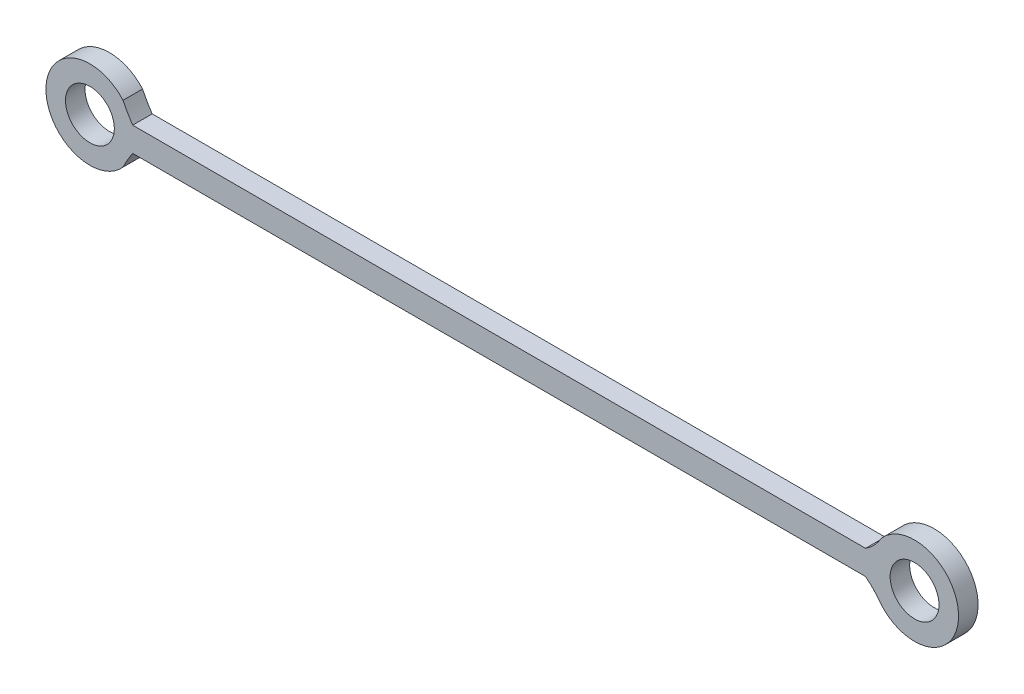
ISO-10303-21;
HEADER;
FILE_DESCRIPTION(('STEP AP214'),'2;1');
FILE_NAME('part.step','',(''),(''),'','','');
FILE_SCHEMA(('AUTOMOTIVE_DESIGN { 1 0 10303 214 1 1 1 1 }'));
ENDSEC;
DATA;
#1=APPLICATION_CONTEXT('core data for automotive mechanical design processes');
#2=APPLICATION_PROTOCOL_DEFINITION('international standard','automotive_design',2000,#1);
#3=PRODUCT_CONTEXT('',#1,'mechanical');
#4=PRODUCT('Part','Part','',(#3));
#5=PRODUCT_RELATED_PRODUCT_CATEGORY('part','',(#4));
#6=PRODUCT_DEFINITION_FORMATION('','',#4);
#7=PRODUCT_DEFINITION_CONTEXT('part definition',#1,'design');
#8=PRODUCT_DEFINITION('design','',#6,#7);
#9=PRODUCT_DEFINITION_SHAPE('','',#8);
#10=(LENGTH_UNIT() NAMED_UNIT(*) SI_UNIT(.MILLI.,.METRE.));
#11=(NAMED_UNIT(*) PLANE_ANGLE_UNIT() SI_UNIT($,.RADIAN.));
#12=(NAMED_UNIT(*) SI_UNIT($,.STERADIAN.) SOLID_ANGLE_UNIT());
#13=UNCERTAINTY_MEASURE_WITH_UNIT(LENGTH_MEASURE(1.E-05),#10,'distance_accuracy_value','');
#14=(GEOMETRIC_REPRESENTATION_CONTEXT(3) GLOBAL_UNCERTAINTY_ASSIGNED_CONTEXT((#13)) GLOBAL_UNIT_ASSIGNED_CONTEXT((#10,
#11,#12)) REPRESENTATION_CONTEXT('',''));
#15=CARTESIAN_POINT('',(0.,0.,0.));
#16=DIRECTION('',(0.,0.,1.));
#17=DIRECTION('',(1.,0.,0.));
#18=AXIS2_PLACEMENT_3D('',#15,#16,#17);
#19=CARTESIAN_POINT('',(-43.5863129452052,-18.5825445098604,4.));
#20=DIRECTION('',(0.,0.,1.));
#21=DIRECTION('',(1.,0.,0.));
#22=AXIS2_PLACEMENT_3D('',#19,#20,#21);
#23=PLANE('',#22);
#24=CARTESIAN_POINT('',(92.5,0.,4.));
#25=DIRECTION('',(0.,0.,1.));
#26=DIRECTION('',(1.,0.,0.));
#27=AXIS2_PLACEMENT_3D('',#24,#25,#26);
#28=CIRCLE('',#27,5.);
#29=CARTESIAN_POINT('',(97.5,0.,4.));
#30=VERTEX_POINT('',#29);
#31=EDGE_CURVE('E176',#30,#30,#28,.T.);
#32=ORIENTED_EDGE('',*,*,#31,.F.);
#33=EDGE_LOOP('',(#32));
#34=FACE_BOUND('',#33,.T.);
#35=CARTESIAN_POINT('',(-43.5863129452052,-18.5825445098604,4.));
#36=DIRECTION('',(0.,0.,-1.));
#37=DIRECTION('',(1.,0.,0.));
#38=AXIS2_PLACEMENT_3D('',#35,#36,#37);
#39=CIRCLE('',#38,28.8163623159094);
#40=CARTESIAN_POINT('',(-69.4720109373007,-5.92105263157895,4.));
#41=VERTEX_POINT('',#40);
#42=CARTESIAN_POINT('',(-67.4972832143122,-2.5,4.));
#43=VERTEX_POINT('',#42);
#44=EDGE_CURVE('E169',#41,#43,#39,.T.);
#45=ORIENTED_EDGE('',*,*,#44,.T.);
#46=DIRECTION('',(1.,0.,0.));
#47=VECTOR('',#46,1.);
#48=CARTESIAN_POINT('',(-67.4972832143122,-2.5,4.));
#49=LINE('',#48,#47);
#50=CARTESIAN_POINT('',(82.4769378781167,-2.5,4.));
#51=VERTEX_POINT('',#50);
#52=EDGE_CURVE('E102',#43,#51,#49,.T.);
#53=ORIENTED_EDGE('',*,*,#52,.T.);
#54=CARTESIAN_POINT('',(72.3573375961199,-15.3486454645009,4.));
#55=DIRECTION('',(0.,0.,-1.));
#56=DIRECTION('',(1.,0.,0.));
#57=AXIS2_PLACEMENT_3D('',#54,#55,#56);
#58=CIRCLE('',#57,16.3552438116902);
#59=CARTESIAN_POINT('',(85.7220109373007,-5.92105263157895,4.));
#60=VERTEX_POINT('',#59);
#61=EDGE_CURVE('E159',#51,#60,#58,.T.);
#62=ORIENTED_EDGE('',*,*,#61,.T.);
#63=CARTESIAN_POINT('',(92.5,0.,4.));
#64=DIRECTION('',(0.,0.,1.));
#65=DIRECTION('',(1.,0.,0.));
#66=AXIS2_PLACEMENT_3D('',#63,#64,#65);
#67=CIRCLE('',#66,8.99999999999999);
#68=CARTESIAN_POINT('',(85.7220109373007,5.92105263157895,4.));
#69=VERTEX_POINT('',#68);
#70=EDGE_CURVE('E155',#60,#69,#67,.T.);
#71=ORIENTED_EDGE('',*,*,#70,.T.);
#72=CARTESIAN_POINT('',(77.0487886944232,10.8985234678227,4.));
#73=DIRECTION('',(0.,0.,-1.));
#74=DIRECTION('',(1.,0.,0.));
#75=AXIS2_PLACEMENT_3D('',#72,#73,#74);
#76=CIRCLE('',#75,10.0000000000001);
#77=CARTESIAN_POINT('',(82.4769378781167,2.49999999999999,4.));
#78=VERTEX_POINT('',#77);
#79=EDGE_CURVE('E121',#69,#78,#76,.T.);
#80=ORIENTED_EDGE('',*,*,#79,.T.);
#81=DIRECTION('',(-1.,0.,0.));
#82=VECTOR('',#81,1.);
#83=CARTESIAN_POINT('',(82.4769378781167,2.49999999999999,4.));
#84=LINE('',#83,#82);
#85=CARTESIAN_POINT('',(-67.4972832143122,2.49999999999999,4.));
#86=VERTEX_POINT('',#85);
#87=EDGE_CURVE('E115',#78,#86,#84,.T.);
#88=ORIENTED_EDGE('',*,*,#87,.T.);
#89=CARTESIAN_POINT('',(-43.5863129452051,18.5825445098603,4.));
#90=DIRECTION('',(0.,0.,-1.));
#91=DIRECTION('',(1.,0.,0.));
#92=AXIS2_PLACEMENT_3D('',#89,#90,#91);
#93=CIRCLE('',#92,28.8163623159094);
#94=CARTESIAN_POINT('',(-69.4720109373007,5.92105263157896,4.));
#95=VERTEX_POINT('',#94);
#96=EDGE_CURVE('E119',#86,#95,#93,.T.);
#97=ORIENTED_EDGE('',*,*,#96,.T.);
#98=CARTESIAN_POINT('',(-76.25,0.,4.));
#99=DIRECTION('',(0.,0.,1.));
#100=DIRECTION('',(1.,0.,0.));
#101=AXIS2_PLACEMENT_3D('',#98,#99,#100);
#102=CIRCLE('',#101,8.99999999999999);
#103=EDGE_CURVE('E59',#95,#41,#102,.T.);
#104=ORIENTED_EDGE('',*,*,#103,.T.);
#105=EDGE_LOOP('',(#45,#53,#62,#71,#80,#88,#97,#104));
#106=FACE_BOUND('',#105,.T.);
#107=CARTESIAN_POINT('',(-76.25,0.,4.));
#108=DIRECTION('',(0.,0.,1.));
#109=DIRECTION('',(1.,0.,0.));
#110=AXIS2_PLACEMENT_3D('',#107,#108,#109);
#111=CIRCLE('',#110,4.99999999999999);
#112=CARTESIAN_POINT('',(-71.25,0.,4.));
#113=VERTEX_POINT('',#112);
#114=EDGE_CURVE('E177',#113,#113,#111,.T.);
#115=ORIENTED_EDGE('',*,*,#114,.F.);
#116=EDGE_LOOP('',(#115));
#117=FACE_BOUND('',#116,.T.);
#118=ADVANCED_FACE('F41',(#34,#106,#117),#23,.T.);
#119=CARTESIAN_POINT('',(-43.5863129452052,-18.5825445098604,0.));
#120=DIRECTION('',(0.,0.,1.));
#121=DIRECTION('',(1.,0.,0.));
#122=AXIS2_PLACEMENT_3D('',#119,#120,#121);
#123=PLANE('',#122);
#124=CARTESIAN_POINT('',(-43.5863129452052,-18.5825445098604,0.));
#125=DIRECTION('',(0.,0.,-1.));
#126=DIRECTION('',(1.,0.,0.));
#127=AXIS2_PLACEMENT_3D('',#124,#125,#126);
#128=CIRCLE('',#127,28.8163623159094);
#129=CARTESIAN_POINT('',(-69.4720109373007,-5.92105263157895,0.));
#130=VERTEX_POINT('',#129);
#131=CARTESIAN_POINT('',(-67.4972832143122,-2.5,0.));
#132=VERTEX_POINT('',#131);
#133=EDGE_CURVE('E182',#130,#132,#128,.T.);
#134=ORIENTED_EDGE('',*,*,#133,.F.);
#135=CARTESIAN_POINT('',(-76.25,0.,0.));
#136=DIRECTION('',(0.,0.,1.));
#137=DIRECTION('',(1.,0.,0.));
#138=AXIS2_PLACEMENT_3D('',#135,#136,#137);
#139=CIRCLE('',#138,8.99999999999999);
#140=CARTESIAN_POINT('',(-69.4720109373007,5.92105263157896,0.));
#141=VERTEX_POINT('',#140);
#142=EDGE_CURVE('E94',#141,#130,#139,.T.);
#143=ORIENTED_EDGE('',*,*,#142,.F.);
#144=CARTESIAN_POINT('',(-43.5863129452051,18.5825445098603,0.));
#145=DIRECTION('',(0.,0.,-1.));
#146=DIRECTION('',(1.,0.,0.));
#147=AXIS2_PLACEMENT_3D('',#144,#145,#146);
#148=CIRCLE('',#147,28.8163623159094);
#149=CARTESIAN_POINT('',(-67.4972832143122,2.49999999999999,0.));
#150=VERTEX_POINT('',#149);
#151=EDGE_CURVE('E88',#150,#141,#148,.T.);
#152=ORIENTED_EDGE('',*,*,#151,.F.);
#153=DIRECTION('',(-1.,0.,0.));
#154=VECTOR('',#153,1.);
#155=CARTESIAN_POINT('',(82.4769378781167,2.49999999999999,0.));
#156=LINE('',#155,#154);
#157=CARTESIAN_POINT('',(82.4769378781167,2.49999999999999,0.));
#158=VERTEX_POINT('',#157);
#159=EDGE_CURVE('E130',#158,#150,#156,.T.);
#160=ORIENTED_EDGE('',*,*,#159,.F.);
#161=CARTESIAN_POINT('',(77.0487886944232,10.8985234678227,0.));
#162=DIRECTION('',(0.,0.,-1.));
#163=DIRECTION('',(1.,0.,0.));
#164=AXIS2_PLACEMENT_3D('',#161,#162,#163);
#165=CIRCLE('',#164,10.0000000000001);
#166=CARTESIAN_POINT('',(85.7220109373007,5.92105263157895,0.));
#167=VERTEX_POINT('',#166);
#168=EDGE_CURVE('E254',#167,#158,#165,.T.);
#169=ORIENTED_EDGE('',*,*,#168,.F.);
#170=CARTESIAN_POINT('',(92.5,0.,0.));
#171=DIRECTION('',(0.,0.,1.));
#172=DIRECTION('',(1.,0.,0.));
#173=AXIS2_PLACEMENT_3D('',#170,#171,#172);
#174=CIRCLE('',#173,8.99999999999999);
#175=CARTESIAN_POINT('',(85.7220109373007,-5.92105263157895,0.));
#176=VERTEX_POINT('',#175);
#177=EDGE_CURVE('E248',#176,#167,#174,.T.);
#178=ORIENTED_EDGE('',*,*,#177,.F.);
#179=CARTESIAN_POINT('',(72.3573375961199,-15.3486454645009,0.));
#180=DIRECTION('',(0.,0.,-1.));
#181=DIRECTION('',(1.,0.,0.));
#182=AXIS2_PLACEMENT_3D('',#179,#180,#181);
#183=CIRCLE('',#182,16.3552438116902);
#184=CARTESIAN_POINT('',(82.4769378781167,-2.5,0.));
#185=VERTEX_POINT('',#184);
#186=EDGE_CURVE('E239',#185,#176,#183,.T.);
#187=ORIENTED_EDGE('',*,*,#186,.F.);
#188=DIRECTION('',(1.,0.,0.));
#189=VECTOR('',#188,1.);
#190=CARTESIAN_POINT('',(-67.4972832143122,-2.5,0.));
#191=LINE('',#190,#189);
#192=EDGE_CURVE('E231',#132,#185,#191,.T.);
#193=ORIENTED_EDGE('',*,*,#192,.F.);
#194=EDGE_LOOP('',(#134,#143,#152,#160,#169,#178,#187,#193));
#195=FACE_BOUND('',#194,.T.);
#196=CARTESIAN_POINT('',(92.5,0.,0.));
#197=DIRECTION('',(0.,0.,1.));
#198=DIRECTION('',(1.,0.,0.));
#199=AXIS2_PLACEMENT_3D('',#196,#197,#198);
#200=CIRCLE('',#199,5.);
#201=CARTESIAN_POINT('',(97.5,0.,0.));
#202=VERTEX_POINT('',#201);
#203=EDGE_CURVE('E173',#202,#202,#200,.T.);
#204=ORIENTED_EDGE('',*,*,#203,.T.);
#205=EDGE_LOOP('',(#204));
#206=FACE_BOUND('',#205,.T.);
#207=CARTESIAN_POINT('',(-76.25,0.,0.));
#208=DIRECTION('',(0.,0.,1.));
#209=DIRECTION('',(1.,0.,0.));
#210=AXIS2_PLACEMENT_3D('',#207,#208,#209);
#211=CIRCLE('',#210,4.99999999999999);
#212=CARTESIAN_POINT('',(-71.25,0.,0.));
#213=VERTEX_POINT('',#212);
#214=EDGE_CURVE('E183',#213,#213,#211,.T.);
#215=ORIENTED_EDGE('',*,*,#214,.T.);
#216=EDGE_LOOP('',(#215));
#217=FACE_BOUND('',#216,.T.);
#218=ADVANCED_FACE('F194',(#195,#206,#217),#123,.F.);
#219=CARTESIAN_POINT('',(-43.5863129452052,-18.5825445098604,4.));
#220=DIRECTION('',(0.,0.,-1.));
#221=DIRECTION('',(-1.,0.,0.));
#222=AXIS2_PLACEMENT_3D('',#219,#220,#221);
#223=CYLINDRICAL_SURFACE('',#222,28.8163623159094);
#224=ORIENTED_EDGE('',*,*,#133,.T.);
#225=DIRECTION('',(0.,0.,-1.));
#226=VECTOR('',#225,1.);
#227=CARTESIAN_POINT('',(-67.4972832143122,-2.5,4.));
#228=LINE('',#227,#226);
#229=EDGE_CURVE('E12',#43,#132,#228,.T.);
#230=ORIENTED_EDGE('',*,*,#229,.F.);
#231=ORIENTED_EDGE('',*,*,#44,.F.);
#232=DIRECTION('',(0.,0.,-1.));
#233=VECTOR('',#232,1.);
#234=CARTESIAN_POINT('',(-69.4720109373007,-5.92105263157895,4.));
#235=LINE('',#234,#233);
#236=EDGE_CURVE('E140',#41,#130,#235,.T.);
#237=ORIENTED_EDGE('',*,*,#236,.T.);
#238=EDGE_LOOP('',(#224,#230,#231,#237));
#239=FACE_BOUND('',#238,.T.);
#240=ADVANCED_FACE('F43',(#239),#223,.F.);
#241=CARTESIAN_POINT('',(-67.4972832143122,-2.5,4.));
#242=DIRECTION('',(0.,1.,0.));
#243=DIRECTION('',(0.,0.,1.));
#244=AXIS2_PLACEMENT_3D('',#241,#242,#243);
#245=PLANE('',#244);
#246=ORIENTED_EDGE('',*,*,#192,.T.);
#247=DIRECTION('',(0.,0.,-1.));
#248=VECTOR('',#247,1.);
#249=CARTESIAN_POINT('',(82.4769378781167,-2.5,4.));
#250=LINE('',#249,#248);
#251=EDGE_CURVE('E51',#51,#185,#250,.T.);
#252=ORIENTED_EDGE('',*,*,#251,.F.);
#253=ORIENTED_EDGE('',*,*,#52,.F.);
#254=ORIENTED_EDGE('',*,*,#229,.T.);
#255=EDGE_LOOP('',(#246,#252,#253,#254));
#256=FACE_BOUND('',#255,.T.);
#257=ADVANCED_FACE('F224',(#256),#245,.F.);
#258=CARTESIAN_POINT('',(72.3573375961199,-15.3486454645009,4.));
#259=DIRECTION('',(0.,0.,-1.));
#260=DIRECTION('',(-1.,0.,0.));
#261=AXIS2_PLACEMENT_3D('',#258,#259,#260);
#262=CYLINDRICAL_SURFACE('',#261,16.3552438116902);
#263=ORIENTED_EDGE('',*,*,#186,.T.);
#264=DIRECTION('',(0.,0.,-1.));
#265=VECTOR('',#264,1.);
#266=CARTESIAN_POINT('',(85.7220109373007,-5.92105263157895,4.));
#267=LINE('',#266,#265);
#268=EDGE_CURVE('E244',#60,#176,#267,.T.);
#269=ORIENTED_EDGE('',*,*,#268,.F.);
#270=ORIENTED_EDGE('',*,*,#61,.F.);
#271=ORIENTED_EDGE('',*,*,#251,.T.);
#272=EDGE_LOOP('',(#263,#269,#270,#271));
#273=FACE_BOUND('',#272,.T.);
#274=ADVANCED_FACE('F221',(#273),#262,.F.);
#275=CARTESIAN_POINT('',(92.5,0.,4.));
#276=DIRECTION('',(0.,0.,-1.));
#277=DIRECTION('',(-1.,0.,0.));
#278=AXIS2_PLACEMENT_3D('',#275,#276,#277);
#279=CYLINDRICAL_SURFACE('',#278,8.99999999999999);
#280=ORIENTED_EDGE('',*,*,#177,.T.);
#281=DIRECTION('',(0.,0.,-1.));
#282=VECTOR('',#281,1.);
#283=CARTESIAN_POINT('',(85.7220109373007,5.92105263157895,4.));
#284=LINE('',#283,#282);
#285=EDGE_CURVE('E269',#69,#167,#284,.T.);
#286=ORIENTED_EDGE('',*,*,#285,.F.);
#287=ORIENTED_EDGE('',*,*,#70,.F.);
#288=ORIENTED_EDGE('',*,*,#268,.T.);
#289=EDGE_LOOP('',(#280,#286,#287,#288));
#290=FACE_BOUND('',#289,.T.);
#291=ADVANCED_FACE('F217',(#290),#279,.T.);
#292=CARTESIAN_POINT('',(77.0487886944232,10.8985234678227,4.));
#293=DIRECTION('',(0.,0.,-1.));
#294=DIRECTION('',(-1.,0.,0.));
#295=AXIS2_PLACEMENT_3D('',#292,#293,#294);
#296=CYLINDRICAL_SURFACE('',#295,10.0000000000001);
#297=ORIENTED_EDGE('',*,*,#168,.T.);
#298=DIRECTION('',(0.,0.,-1.));
#299=VECTOR('',#298,1.);
#300=CARTESIAN_POINT('',(82.4769378781167,2.49999999999999,4.));
#301=LINE('',#300,#299);
#302=EDGE_CURVE('E132',#78,#158,#301,.T.);
#303=ORIENTED_EDGE('',*,*,#302,.F.);
#304=ORIENTED_EDGE('',*,*,#79,.F.);
#305=ORIENTED_EDGE('',*,*,#285,.T.);
#306=EDGE_LOOP('',(#297,#303,#304,#305));
#307=FACE_BOUND('',#306,.T.);
#308=ADVANCED_FACE('F214',(#307),#296,.F.);
#309=CARTESIAN_POINT('',(82.4769378781167,2.49999999999999,4.));
#310=DIRECTION('',(0.,-1.,0.));
#311=DIRECTION('',(0.,0.,-1.));
#312=AXIS2_PLACEMENT_3D('',#309,#310,#311);
#313=PLANE('',#312);
#314=ORIENTED_EDGE('',*,*,#159,.T.);
#315=DIRECTION('',(0.,0.,-1.));
#316=VECTOR('',#315,1.);
#317=CARTESIAN_POINT('',(-67.4972832143122,2.49999999999999,4.));
#318=LINE('',#317,#316);
#319=EDGE_CURVE('E127',#86,#150,#318,.T.);
#320=ORIENTED_EDGE('',*,*,#319,.F.);
#321=ORIENTED_EDGE('',*,*,#87,.F.);
#322=ORIENTED_EDGE('',*,*,#302,.T.);
#323=EDGE_LOOP('',(#314,#320,#321,#322));
#324=FACE_BOUND('',#323,.T.);
#325=ADVANCED_FACE('F128',(#324),#313,.F.);
#326=CARTESIAN_POINT('',(-43.5863129452051,18.5825445098603,4.));
#327=DIRECTION('',(0.,0.,-1.));
#328=DIRECTION('',(-1.,0.,0.));
#329=AXIS2_PLACEMENT_3D('',#326,#327,#328);
#330=CYLINDRICAL_SURFACE('',#329,28.8163623159094);
#331=ORIENTED_EDGE('',*,*,#151,.T.);
#332=DIRECTION('',(0.,0.,-1.));
#333=VECTOR('',#332,1.);
#334=CARTESIAN_POINT('',(-69.4720109373007,5.92105263157896,4.));
#335=LINE('',#334,#333);
#336=EDGE_CURVE('E133',#95,#141,#335,.T.);
#337=ORIENTED_EDGE('',*,*,#336,.F.);
#338=ORIENTED_EDGE('',*,*,#96,.F.);
#339=ORIENTED_EDGE('',*,*,#319,.T.);
#340=EDGE_LOOP('',(#331,#337,#338,#339));
#341=FACE_BOUND('',#340,.T.);
#342=ADVANCED_FACE('F135',(#341),#330,.F.);
#343=CARTESIAN_POINT('',(-76.25,0.,4.));
#344=DIRECTION('',(0.,0.,-1.));
#345=DIRECTION('',(-1.,0.,0.));
#346=AXIS2_PLACEMENT_3D('',#343,#344,#345);
#347=CYLINDRICAL_SURFACE('',#346,8.99999999999999);
#348=ORIENTED_EDGE('',*,*,#142,.T.);
#349=ORIENTED_EDGE('',*,*,#236,.F.);
#350=ORIENTED_EDGE('',*,*,#103,.F.);
#351=ORIENTED_EDGE('',*,*,#336,.T.);
#352=EDGE_LOOP('',(#348,#349,#350,#351));
#353=FACE_BOUND('',#352,.T.);
#354=ADVANCED_FACE('F207',(#353),#347,.T.);
#355=CARTESIAN_POINT('',(92.5,0.,4.));
#356=DIRECTION('',(0.,0.,-1.));
#357=DIRECTION('',(-1.,0.,0.));
#358=AXIS2_PLACEMENT_3D('',#355,#356,#357);
#359=CYLINDRICAL_SURFACE('',#358,5.);
#360=ORIENTED_EDGE('',*,*,#31,.T.);
#361=EDGE_LOOP('',(#360));
#362=FACE_BOUND('',#361,.T.);
#363=ORIENTED_EDGE('',*,*,#203,.F.);
#364=EDGE_LOOP('',(#363));
#365=FACE_BOUND('',#364,.T.);
#366=ADVANCED_FACE('F204',(#362,#365),#359,.F.);
#367=CARTESIAN_POINT('',(-76.25,0.,4.));
#368=DIRECTION('',(0.,0.,-1.));
#369=DIRECTION('',(-1.,0.,0.));
#370=AXIS2_PLACEMENT_3D('',#367,#368,#369);
#371=CYLINDRICAL_SURFACE('',#370,4.99999999999999);
#372=ORIENTED_EDGE('',*,*,#114,.T.);
#373=EDGE_LOOP('',(#372));
#374=FACE_BOUND('',#373,.T.);
#375=ORIENTED_EDGE('',*,*,#214,.F.);
#376=EDGE_LOOP('',(#375));
#377=FACE_BOUND('',#376,.T.);
#378=ADVANCED_FACE('F191',(#374,#377),#371,.F.);
#379=CLOSED_SHELL('',(#118,#218,#240,#257,#274,#291,#308,#325,#342,#354,#366,#378));
#380=MANIFOLD_SOLID_BREP('B2',#379);
#381=ADVANCED_BREP_SHAPE_REPRESENTATION('',(#18,#380),#14);
#382=SHAPE_DEFINITION_REPRESENTATION(#9,#381);
ENDSEC;
END-ISO-10303-21;
